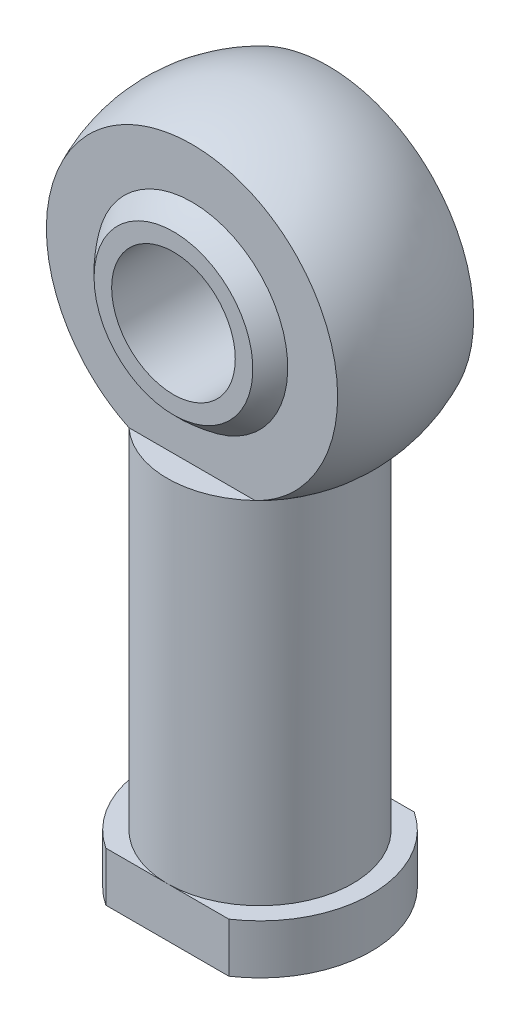
ISO-10303-21;
HEADER;
FILE_DESCRIPTION(('STEP AP214'),'2;1');
FILE_NAME('part.step','',(''),(''),'','','');
FILE_SCHEMA(('AUTOMOTIVE_DESIGN { 1 0 10303 214 1 1 1 1 }'));
ENDSEC;
DATA;
#1=APPLICATION_CONTEXT('core data for automotive mechanical design processes');
#2=APPLICATION_PROTOCOL_DEFINITION('international standard','automotive_design',2000,#1);
#3=PRODUCT_CONTEXT('',#1,'mechanical');
#4=PRODUCT('Part','Part','',(#3));
#5=PRODUCT_RELATED_PRODUCT_CATEGORY('part','',(#4));
#6=PRODUCT_DEFINITION_FORMATION('','',#4);
#7=PRODUCT_DEFINITION_CONTEXT('part definition',#1,'design');
#8=PRODUCT_DEFINITION('design','',#6,#7);
#9=PRODUCT_DEFINITION_SHAPE('','',#8);
#10=(LENGTH_UNIT() NAMED_UNIT(*) SI_UNIT(.MILLI.,.METRE.));
#11=(NAMED_UNIT(*) PLANE_ANGLE_UNIT() SI_UNIT($,.RADIAN.));
#12=(NAMED_UNIT(*) SI_UNIT($,.STERADIAN.) SOLID_ANGLE_UNIT());
#13=UNCERTAINTY_MEASURE_WITH_UNIT(LENGTH_MEASURE(1.E-05),#10,'distance_accuracy_value','');
#14=(GEOMETRIC_REPRESENTATION_CONTEXT(3) GLOBAL_UNCERTAINTY_ASSIGNED_CONTEXT((#13)) GLOBAL_UNIT_ASSIGNED_CONTEXT((#10,
#11,#12)) REPRESENTATION_CONTEXT('',''));
#15=CARTESIAN_POINT('',(0.,0.,0.));
#16=DIRECTION('',(0.,0.,1.));
#17=DIRECTION('',(1.,0.,0.));
#18=AXIS2_PLACEMENT_3D('',#15,#16,#17);
#19=CARTESIAN_POINT('',(0.,4.,0.));
#20=DIRECTION('',(0.,-1.,0.));
#21=DIRECTION('',(0.,0.,-1.));
#22=AXIS2_PLACEMENT_3D('',#19,#20,#21);
#23=PLANE('',#22);
#24=DIRECTION('',(1.,0.,0.));
#25=VECTOR('',#24,1.);
#26=CARTESIAN_POINT('',(0.,4.,-7.5));
#27=LINE('',#26,#25);
#28=CARTESIAN_POINT('',(-4.9749371855331,4.,-7.5));
#29=VERTEX_POINT('',#28);
#30=CARTESIAN_POINT('',(0.,4.,-7.5));
#31=VERTEX_POINT('',#30);
#32=EDGE_CURVE('E157',#29,#31,#27,.T.);
#33=ORIENTED_EDGE('',*,*,#32,.F.);
#34=CARTESIAN_POINT('',(0.,4.,0.));
#35=DIRECTION('',(0.,-1.,0.));
#36=DIRECTION('',(0.,0.,-1.));
#37=AXIS2_PLACEMENT_3D('',#34,#35,#36);
#38=CIRCLE('',#37,9.);
#39=CARTESIAN_POINT('',(-4.9749371855331,4.,7.5));
#40=VERTEX_POINT('',#39);
#41=EDGE_CURVE('E128',#40,#29,#38,.T.);
#42=ORIENTED_EDGE('',*,*,#41,.F.);
#43=DIRECTION('',(-1.,0.,0.));
#44=VECTOR('',#43,1.);
#45=CARTESIAN_POINT('',(0.,4.,7.5));
#46=LINE('',#45,#44);
#47=CARTESIAN_POINT('',(0.,4.,7.5));
#48=VERTEX_POINT('',#47);
#49=EDGE_CURVE('E256',#48,#40,#46,.T.);
#50=ORIENTED_EDGE('',*,*,#49,.F.);
#51=CARTESIAN_POINT('',(0.,4.,0.));
#52=DIRECTION('',(0.,-1.,0.));
#53=DIRECTION('',(0.,0.,-1.));
#54=AXIS2_PLACEMENT_3D('',#51,#52,#53);
#55=CIRCLE('',#54,7.5);
#56=EDGE_CURVE('E140',#48,#31,#55,.T.);
#57=ORIENTED_EDGE('',*,*,#56,.T.);
#58=EDGE_LOOP('',(#33,#42,#50,#57));
#59=FACE_BOUND('',#58,.T.);
#60=ADVANCED_FACE('F45',(#59),#23,.F.);
#61=CARTESIAN_POINT('',(4.9749371855331,4.,-7.5));
#62=VERTEX_POINT('',#61);
#63=EDGE_CURVE('E164',#31,#62,#27,.T.);
#64=ORIENTED_EDGE('',*,*,#63,.F.);
#65=EDGE_CURVE('E141',#31,#48,#55,.T.);
#66=ORIENTED_EDGE('',*,*,#65,.T.);
#67=CARTESIAN_POINT('',(4.9749371855331,4.,7.5));
#68=VERTEX_POINT('',#67);
#69=EDGE_CURVE('E259',#68,#48,#46,.T.);
#70=ORIENTED_EDGE('',*,*,#69,.F.);
#71=EDGE_CURVE('E122',#62,#68,#38,.T.);
#72=ORIENTED_EDGE('',*,*,#71,.F.);
#73=EDGE_LOOP('',(#64,#66,#70,#72));
#74=FACE_BOUND('',#73,.T.);
#75=ADVANCED_FACE('F223',(#74),#23,.F.);
#76=CARTESIAN_POINT('',(0.,0.,0.));
#77=DIRECTION('',(0.,-1.,0.));
#78=DIRECTION('',(0.,0.,-1.));
#79=AXIS2_PLACEMENT_3D('',#76,#77,#78);
#80=CYLINDRICAL_SURFACE('',#79,9.);
#81=DIRECTION('',(0.,-1.,0.));
#82=VECTOR('',#81,1.);
#83=CARTESIAN_POINT('',(4.9749371855331,0.,-7.5));
#84=LINE('',#83,#82);
#85=CARTESIAN_POINT('',(4.9749371855331,0.,-7.5));
#86=VERTEX_POINT('',#85);
#87=EDGE_CURVE('E72',#62,#86,#84,.T.);
#88=ORIENTED_EDGE('',*,*,#87,.F.);
#89=ORIENTED_EDGE('',*,*,#71,.T.);
#90=DIRECTION('',(0.,-1.,0.));
#91=VECTOR('',#90,1.);
#92=CARTESIAN_POINT('',(4.9749371855331,0.,7.5));
#93=LINE('',#92,#91);
#94=CARTESIAN_POINT('',(4.9749371855331,0.,7.5));
#95=VERTEX_POINT('',#94);
#96=EDGE_CURVE('E108',#95,#68,#93,.F.);
#97=ORIENTED_EDGE('',*,*,#96,.F.);
#98=CARTESIAN_POINT('',(0.,0.,0.));
#99=DIRECTION('',(0.,-1.,0.));
#100=DIRECTION('',(0.,0.,-1.));
#101=AXIS2_PLACEMENT_3D('',#98,#99,#100);
#102=CIRCLE('',#101,9.);
#103=EDGE_CURVE('E120',#86,#95,#102,.T.);
#104=ORIENTED_EDGE('',*,*,#103,.F.);
#105=EDGE_LOOP('',(#88,#89,#97,#104));
#106=FACE_BOUND('',#105,.T.);
#107=ADVANCED_FACE('F119',(#106),#80,.T.);
#108=DIRECTION('',(0.,-1.,0.));
#109=VECTOR('',#108,1.);
#110=CARTESIAN_POINT('',(-4.9749371855331,0.,-7.5));
#111=LINE('',#110,#109);
#112=CARTESIAN_POINT('',(-4.9749371855331,0.,-7.5));
#113=VERTEX_POINT('',#112);
#114=EDGE_CURVE('E261',#113,#29,#111,.F.);
#115=ORIENTED_EDGE('',*,*,#114,.F.);
#116=CARTESIAN_POINT('',(-4.9749371855331,0.,7.5));
#117=VERTEX_POINT('',#116);
#118=EDGE_CURVE('E129',#117,#113,#102,.T.);
#119=ORIENTED_EDGE('',*,*,#118,.F.);
#120=DIRECTION('',(0.,-1.,0.));
#121=VECTOR('',#120,1.);
#122=CARTESIAN_POINT('',(-4.9749371855331,0.,7.5));
#123=LINE('',#122,#121);
#124=EDGE_CURVE('E64',#40,#117,#123,.T.);
#125=ORIENTED_EDGE('',*,*,#124,.F.);
#126=ORIENTED_EDGE('',*,*,#41,.T.);
#127=EDGE_LOOP('',(#115,#119,#125,#126));
#128=FACE_BOUND('',#127,.T.);
#129=ADVANCED_FACE('F234',(#128),#80,.T.);
#130=CARTESIAN_POINT('',(0.,0.,0.));
#131=DIRECTION('',(0.,1.,0.));
#132=DIRECTION('',(0.,0.,1.));
#133=AXIS2_PLACEMENT_3D('',#130,#131,#132);
#134=PLANE('',#133);
#135=CARTESIAN_POINT('',(0.,0.,0.));
#136=DIRECTION('',(0.,1.,0.));
#137=DIRECTION('',(0.,0.,1.));
#138=AXIS2_PLACEMENT_3D('',#135,#136,#137);
#139=CIRCLE('',#138,5.);
#140=CARTESIAN_POINT('',(0.,0.,5.));
#141=VERTEX_POINT('',#140);
#142=EDGE_CURVE('E49',#141,#141,#139,.F.);
#143=ORIENTED_EDGE('',*,*,#142,.F.);
#144=EDGE_LOOP('',(#143));
#145=FACE_BOUND('',#144,.T.);
#146=DIRECTION('',(-1.,0.,0.));
#147=VECTOR('',#146,1.);
#148=CARTESIAN_POINT('',(0.,0.,-7.5));
#149=LINE('',#148,#147);
#150=EDGE_CURVE('E126',#86,#113,#149,.T.);
#151=ORIENTED_EDGE('',*,*,#150,.F.);
#152=ORIENTED_EDGE('',*,*,#103,.T.);
#153=DIRECTION('',(1.,0.,0.));
#154=VECTOR('',#153,1.);
#155=CARTESIAN_POINT('',(0.,0.,7.5));
#156=LINE('',#155,#154);
#157=EDGE_CURVE('E105',#117,#95,#156,.T.);
#158=ORIENTED_EDGE('',*,*,#157,.F.);
#159=ORIENTED_EDGE('',*,*,#118,.T.);
#160=EDGE_LOOP('',(#151,#152,#158,#159));
#161=FACE_BOUND('',#160,.T.);
#162=ADVANCED_FACE('F125',(#145,#161),#134,.F.);
#163=CARTESIAN_POINT('',(0.,43.,0.));
#164=DIRECTION('',(0.,-1.,0.));
#165=DIRECTION('',(-1.,0.,0.));
#166=AXIS2_PLACEMENT_3D('',#163,#164,#165);
#167=SPHERICAL_SURFACE('',#166,13.);
#168=CARTESIAN_POINT('',(0.,32.3816197092023,0.));
#169=DIRECTION('',(0.,-1.,0.));
#170=DIRECTION('',(0.,0.,-1.));
#171=AXIS2_PLACEMENT_3D('',#168,#169,#170);
#172=CIRCLE('',#171,7.5);
#173=CARTESIAN_POINT('',(-5.09901951359277,32.3816197092023,5.50000000000001));
#174=VERTEX_POINT('',#173);
#175=CARTESIAN_POINT('',(-5.09901951359277,32.3816197092023,-5.50000000000001));
#176=VERTEX_POINT('',#175);
#177=EDGE_CURVE('E197',#174,#176,#172,.T.);
#178=ORIENTED_EDGE('',*,*,#177,.F.);
#179=CARTESIAN_POINT('',(0.,43.,5.50000000000001));
#180=DIRECTION('',(0.,0.,-1.));
#181=DIRECTION('',(0.,1.,0.));
#182=AXIS2_PLACEMENT_3D('',#179,#180,#181);
#183=CIRCLE('',#182,11.7792189893897);
#184=CARTESIAN_POINT('',(5.09901951359277,32.3816197092023,5.50000000000001));
#185=VERTEX_POINT('',#184);
#186=EDGE_CURVE('E135',#174,#185,#183,.T.);
#187=ORIENTED_EDGE('',*,*,#186,.T.);
#188=CARTESIAN_POINT('',(5.09901951359277,32.3816197092023,-5.50000000000001));
#189=VERTEX_POINT('',#188);
#190=EDGE_CURVE('E12',#189,#185,#172,.T.);
#191=ORIENTED_EDGE('',*,*,#190,.F.);
#192=CARTESIAN_POINT('',(0.,43.,-5.50000000000001));
#193=DIRECTION('',(0.,0.,1.));
#194=DIRECTION('',(0.,-1.,0.));
#195=AXIS2_PLACEMENT_3D('',#192,#193,#194);
#196=CIRCLE('',#195,11.7792189893897);
#197=EDGE_CURVE('E184',#189,#176,#196,.T.);
#198=ORIENTED_EDGE('',*,*,#197,.T.);
#199=EDGE_LOOP('',(#178,#187,#191,#198));
#200=FACE_BOUND('',#199,.T.);
#201=ADVANCED_FACE('F47',(#200),#167,.T.);
#202=CARTESIAN_POINT('',(0.,0.,0.));
#203=DIRECTION('',(0.,-1.,0.));
#204=DIRECTION('',(0.,0.,-1.));
#205=AXIS2_PLACEMENT_3D('',#202,#203,#204);
#206=CYLINDRICAL_SURFACE('',#205,7.5);
#207=EDGE_CURVE('E57',#176,#189,#172,.T.);
#208=ORIENTED_EDGE('',*,*,#207,.T.);
#209=ORIENTED_EDGE('',*,*,#190,.T.);
#210=EDGE_CURVE('E55',#185,#174,#172,.T.);
#211=ORIENTED_EDGE('',*,*,#210,.T.);
#212=ORIENTED_EDGE('',*,*,#177,.T.);
#213=EDGE_LOOP('',(#208,#209,#211,#212));
#214=FACE_BOUND('',#213,.T.);
#215=ORIENTED_EDGE('',*,*,#65,.F.);
#216=ORIENTED_EDGE('',*,*,#56,.F.);
#217=EDGE_LOOP('',(#215,#216));
#218=FACE_BOUND('',#217,.T.);
#219=ADVANCED_FACE('F200',(#214,#218),#206,.T.);
#220=CARTESIAN_POINT('',(-13.,62.8909424581404,-5.50000000000002));
#221=DIRECTION('',(0.,0.,1.));
#222=DIRECTION('',(0.,-1.,0.));
#223=AXIS2_PLACEMENT_3D('',#220,#221,#222);
#224=PLANE('',#223);
#225=CARTESIAN_POINT('',(0.,43.,-5.50000000000001));
#226=DIRECTION('',(0.,0.,1.));
#227=DIRECTION('',(0.,-1.,0.));
#228=AXIS2_PLACEMENT_3D('',#225,#226,#227);
#229=CIRCLE('',#228,7.74596669241483);
#230=CARTESIAN_POINT('',(0.,35.2540333075852,-5.50000000000001));
#231=VERTEX_POINT('',#230);
#232=EDGE_CURVE('E175',#231,#231,#229,.F.);
#233=ORIENTED_EDGE('',*,*,#232,.F.);
#234=EDGE_LOOP('',(#233));
#235=FACE_BOUND('',#234,.T.);
#236=DIRECTION('',(1.,0.,0.));
#237=VECTOR('',#236,1.);
#238=CARTESIAN_POINT('',(-13.,32.3816197092023,-5.50000000000001));
#239=LINE('',#238,#237);
#240=EDGE_CURVE('E179',#176,#189,#239,.T.);
#241=ORIENTED_EDGE('',*,*,#240,.F.);
#242=ORIENTED_EDGE('',*,*,#197,.F.);
#243=EDGE_LOOP('',(#241,#242));
#244=FACE_BOUND('',#243,.T.);
#245=ADVANCED_FACE('F208',(#235,#244),#224,.F.);
#246=CARTESIAN_POINT('',(-13.,32.3816197092023,-23.0792890347279));
#247=DIRECTION('',(0.,-1.,0.));
#248=DIRECTION('',(0.,0.,-1.));
#249=AXIS2_PLACEMENT_3D('',#246,#247,#248);
#250=PLANE('',#249);
#251=ORIENTED_EDGE('',*,*,#207,.F.);
#252=ORIENTED_EDGE('',*,*,#240,.T.);
#253=EDGE_LOOP('',(#251,#252));
#254=FACE_BOUND('',#253,.T.);
#255=ADVANCED_FACE('F206',(#254),#250,.F.);
#256=CARTESIAN_POINT('',(-13.,62.8909424581404,5.50000000000002));
#257=DIRECTION('',(0.,0.,-1.));
#258=DIRECTION('',(0.,1.,0.));
#259=AXIS2_PLACEMENT_3D('',#256,#257,#258);
#260=PLANE('',#259);
#261=CARTESIAN_POINT('',(0.,43.,5.50000000000001));
#262=DIRECTION('',(0.,0.,-1.));
#263=DIRECTION('',(0.,1.,0.));
#264=AXIS2_PLACEMENT_3D('',#261,#262,#263);
#265=CIRCLE('',#264,7.74596669241483);
#266=CARTESIAN_POINT('',(0.,50.7459666924148,5.50000000000001));
#267=VERTEX_POINT('',#266);
#268=EDGE_CURVE('E153',#267,#267,#265,.F.);
#269=ORIENTED_EDGE('',*,*,#268,.F.);
#270=EDGE_LOOP('',(#269));
#271=FACE_BOUND('',#270,.T.);
#272=DIRECTION('',(1.,0.,0.));
#273=VECTOR('',#272,1.);
#274=CARTESIAN_POINT('',(-13.,32.3816197092023,5.50000000000001));
#275=LINE('',#274,#273);
#276=EDGE_CURVE('E180',#174,#185,#275,.T.);
#277=ORIENTED_EDGE('',*,*,#276,.T.);
#278=ORIENTED_EDGE('',*,*,#186,.F.);
#279=EDGE_LOOP('',(#277,#278));
#280=FACE_BOUND('',#279,.T.);
#281=ADVANCED_FACE('F217',(#271,#280),#260,.F.);
#282=CARTESIAN_POINT('',(-13.,32.3816197092023,23.0792890347279));
#283=DIRECTION('',(0.,-1.,0.));
#284=DIRECTION('',(0.,0.,-1.));
#285=AXIS2_PLACEMENT_3D('',#282,#283,#284);
#286=PLANE('',#285);
#287=ORIENTED_EDGE('',*,*,#210,.F.);
#288=ORIENTED_EDGE('',*,*,#276,.F.);
#289=EDGE_LOOP('',(#287,#288));
#290=FACE_BOUND('',#289,.T.);
#291=ADVANCED_FACE('F301',(#290),#286,.F.);
#292=CARTESIAN_POINT('',(0.,43.,0.));
#293=DIRECTION('',(0.,-1.,0.));
#294=DIRECTION('',(-1.,0.,0.));
#295=AXIS2_PLACEMENT_3D('',#292,#293,#294);
#296=SPHERICAL_SURFACE('',#295,9.5);
#297=CARTESIAN_POINT('',(0.,43.,0.));
#298=DIRECTION('',(0.,0.,-1.));
#299=DIRECTION('',(-1.,0.,0.));
#300=AXIS2_PLACEMENT_3D('',#297,#298,#299);
#301=SPHERICAL_SURFACE('',#300,9.5);
#302=CARTESIAN_POINT('',(0.,43.,7.));
#303=DIRECTION('',(0.,0.,-1.));
#304=DIRECTION('',(-1.,0.,0.));
#305=AXIS2_PLACEMENT_3D('',#302,#303,#304);
#306=CIRCLE('',#305,6.42261628933256);
#307=CARTESIAN_POINT('',(-6.42261628933256,43.,7.));
#308=VERTEX_POINT('',#307);
#309=EDGE_CURVE('E149',#308,#308,#306,.T.);
#310=ORIENTED_EDGE('',*,*,#309,.T.);
#311=EDGE_LOOP('',(#310));
#312=FACE_BOUND('',#311,.T.);
#313=ORIENTED_EDGE('',*,*,#268,.T.);
#314=EDGE_LOOP('',(#313));
#315=FACE_BOUND('',#314,.T.);
#316=ADVANCED_FACE('F299',(#312,#315),#301,.T.);
#317=CARTESIAN_POINT('',(0.,43.,0.));
#318=DIRECTION('',(0.,0.,1.));
#319=DIRECTION('',(1.,0.,0.));
#320=AXIS2_PLACEMENT_3D('',#317,#318,#319);
#321=SPHERICAL_SURFACE('',#320,9.5);
#322=CARTESIAN_POINT('',(0.,43.,-7.));
#323=DIRECTION('',(0.,0.,1.));
#324=DIRECTION('',(1.,0.,0.));
#325=AXIS2_PLACEMENT_3D('',#322,#323,#324);
#326=CIRCLE('',#325,6.42261628933256);
#327=CARTESIAN_POINT('',(6.42261628933256,43.,-7.));
#328=VERTEX_POINT('',#327);
#329=EDGE_CURVE('E145',#328,#328,#326,.T.);
#330=ORIENTED_EDGE('',*,*,#329,.T.);
#331=EDGE_LOOP('',(#330));
#332=FACE_BOUND('',#331,.T.);
#333=ORIENTED_EDGE('',*,*,#232,.T.);
#334=EDGE_LOOP('',(#333));
#335=FACE_BOUND('',#334,.T.);
#336=ADVANCED_FACE('F295',(#332,#335),#321,.T.);
#337=CARTESIAN_POINT('',(-13.,55.339914288414,-7.));
#338=DIRECTION('',(0.,0.,1.));
#339=DIRECTION('',(1.,0.,0.));
#340=AXIS2_PLACEMENT_3D('',#337,#338,#339);
#341=PLANE('',#340);
#342=CARTESIAN_POINT('',(0.,43.,-7.));
#343=DIRECTION('',(0.,0.,1.));
#344=DIRECTION('',(1.,0.,0.));
#345=AXIS2_PLACEMENT_3D('',#342,#343,#344);
#346=CIRCLE('',#345,5.);
#347=CARTESIAN_POINT('',(5.,43.,-7.));
#348=VERTEX_POINT('',#347);
#349=EDGE_CURVE('E150',#348,#348,#346,.T.);
#350=ORIENTED_EDGE('',*,*,#349,.T.);
#351=EDGE_LOOP('',(#350));
#352=FACE_BOUND('',#351,.T.);
#353=ORIENTED_EDGE('',*,*,#329,.F.);
#354=EDGE_LOOP('',(#353));
#355=FACE_BOUND('',#354,.T.);
#356=ADVANCED_FACE('F292',(#352,#355),#341,.F.);
#357=CARTESIAN_POINT('',(-13.,55.339914288414,7.));
#358=DIRECTION('',(0.,0.,-1.));
#359=DIRECTION('',(-1.,0.,0.));
#360=AXIS2_PLACEMENT_3D('',#357,#358,#359);
#361=PLANE('',#360);
#362=CARTESIAN_POINT('',(0.,43.,7.));
#363=DIRECTION('',(0.,0.,-1.));
#364=DIRECTION('',(-1.,0.,0.));
#365=AXIS2_PLACEMENT_3D('',#362,#363,#364);
#366=CIRCLE('',#365,5.);
#367=CARTESIAN_POINT('',(-5.,43.,7.));
#368=VERTEX_POINT('',#367);
#369=EDGE_CURVE('E154',#368,#368,#366,.T.);
#370=ORIENTED_EDGE('',*,*,#369,.T.);
#371=EDGE_LOOP('',(#370));
#372=FACE_BOUND('',#371,.T.);
#373=ORIENTED_EDGE('',*,*,#309,.F.);
#374=EDGE_LOOP('',(#373));
#375=FACE_BOUND('',#374,.T.);
#376=ADVANCED_FACE('F288',(#372,#375),#361,.F.);
#377=CARTESIAN_POINT('',(0.,43.,-9.));
#378=DIRECTION('',(0.,0.,1.));
#379=DIRECTION('',(1.,0.,0.));
#380=AXIS2_PLACEMENT_3D('',#377,#378,#379);
#381=CYLINDRICAL_SURFACE('',#380,5.);
#382=ORIENTED_EDGE('',*,*,#369,.F.);
#383=EDGE_LOOP('',(#382));
#384=FACE_BOUND('',#383,.T.);
#385=ORIENTED_EDGE('',*,*,#349,.F.);
#386=EDGE_LOOP('',(#385));
#387=FACE_BOUND('',#386,.T.);
#388=ADVANCED_FACE('F283',(#384,#387),#381,.F.);
#389=CARTESIAN_POINT('',(-7.56111721977776,56.,7.5));
#390=DIRECTION('',(0.,0.,1.));
#391=DIRECTION('',(1.,0.,0.));
#392=AXIS2_PLACEMENT_3D('',#389,#390,#391);
#393=PLANE('',#392);
#394=ORIENTED_EDGE('',*,*,#69,.T.);
#395=ORIENTED_EDGE('',*,*,#49,.T.);
#396=ORIENTED_EDGE('',*,*,#124,.T.);
#397=ORIENTED_EDGE('',*,*,#157,.T.);
#398=ORIENTED_EDGE('',*,*,#96,.T.);
#399=EDGE_LOOP('',(#394,#395,#396,#397,#398));
#400=FACE_BOUND('',#399,.T.);
#401=ADVANCED_FACE('F107',(#400),#393,.T.);
#402=CARTESIAN_POINT('',(-7.56111721977776,56.,-7.5));
#403=DIRECTION('',(0.,0.,-1.));
#404=DIRECTION('',(-1.,0.,0.));
#405=AXIS2_PLACEMENT_3D('',#402,#403,#404);
#406=PLANE('',#405);
#407=ORIENTED_EDGE('',*,*,#32,.T.);
#408=ORIENTED_EDGE('',*,*,#63,.T.);
#409=ORIENTED_EDGE('',*,*,#87,.T.);
#410=ORIENTED_EDGE('',*,*,#150,.T.);
#411=ORIENTED_EDGE('',*,*,#114,.T.);
#412=EDGE_LOOP('',(#407,#408,#409,#410,#411));
#413=FACE_BOUND('',#412,.T.);
#414=ADVANCED_FACE('F265',(#413),#406,.T.);
#415=CARTESIAN_POINT('',(0.,-1.2E-05,0.));
#416=DIRECTION('',(0.,1.,0.));
#417=DIRECTION('',(0.,0.,1.));
#418=AXIS2_PLACEMENT_3D('',#415,#416,#417);
#419=CYLINDRICAL_SURFACE('',#418,5.);
#420=CARTESIAN_POINT('',(0.,25.,0.));
#421=DIRECTION('',(0.,-1.,0.));
#422=DIRECTION('',(0.,0.,-1.));
#423=AXIS2_PLACEMENT_3D('',#420,#421,#422);
#424=CIRCLE('',#423,5.);
#425=CARTESIAN_POINT('',(0.,25.,5.));
#426=VERTEX_POINT('',#425);
#427=EDGE_CURVE('E247',#426,#426,#424,.T.);
#428=CARTESIAN_POINT('',(0.,25.,5.));
#429=CARTESIAN_POINT('',(0.,24.7395833333333,5.));
#430=CARTESIAN_POINT('',(0.,24.4791666666667,5.));
#431=CARTESIAN_POINT('',(0.,23.9583333333333,5.));
#432=CARTESIAN_POINT('',(0.,23.6979166666667,5.));
#433=CARTESIAN_POINT('',(0.,23.1770833333333,5.));
#434=CARTESIAN_POINT('',(0.,22.9166666666667,5.));
#435=CARTESIAN_POINT('',(0.,22.3958333333333,5.));
#436=CARTESIAN_POINT('',(0.,22.1354166666667,5.));
#437=CARTESIAN_POINT('',(0.,21.6145833333333,5.));
#438=CARTESIAN_POINT('',(0.,21.3541666666667,5.));
#439=CARTESIAN_POINT('',(0.,20.8333333333333,5.));
#440=CARTESIAN_POINT('',(0.,20.5729166666667,5.));
#441=CARTESIAN_POINT('',(0.,20.0520833333333,5.));
#442=CARTESIAN_POINT('',(0.,19.7916666666667,5.));
#443=CARTESIAN_POINT('',(0.,19.2708333333333,5.));
#444=CARTESIAN_POINT('',(0.,19.0104166666667,5.));
#445=CARTESIAN_POINT('',(0.,18.4895833333333,5.));
#446=CARTESIAN_POINT('',(0.,18.2291666666667,5.));
#447=CARTESIAN_POINT('',(0.,17.7083333333333,5.));
#448=CARTESIAN_POINT('',(0.,17.4479166666667,5.));
#449=CARTESIAN_POINT('',(0.,16.9270833333333,5.));
#450=CARTESIAN_POINT('',(0.,16.6666666666667,5.));
#451=CARTESIAN_POINT('',(0.,16.1458333333333,5.));
#452=CARTESIAN_POINT('',(0.,15.8854166666667,5.));
#453=CARTESIAN_POINT('',(0.,15.3645833333333,5.));
#454=CARTESIAN_POINT('',(0.,15.1041666666667,5.));
#455=CARTESIAN_POINT('',(0.,14.5833333333333,5.));
#456=CARTESIAN_POINT('',(0.,14.3229166666667,5.));
#457=CARTESIAN_POINT('',(0.,13.8020833333333,5.));
#458=CARTESIAN_POINT('',(0.,13.5416666666667,5.));
#459=CARTESIAN_POINT('',(0.,13.0208333333333,5.));
#460=CARTESIAN_POINT('',(0.,12.7604166666667,5.));
#461=CARTESIAN_POINT('',(0.,12.2395833333333,5.));
#462=CARTESIAN_POINT('',(0.,11.9791666666667,5.));
#463=CARTESIAN_POINT('',(0.,11.4583333333333,5.));
#464=CARTESIAN_POINT('',(0.,11.1979166666667,5.));
#465=CARTESIAN_POINT('',(0.,10.6770833333333,5.));
#466=CARTESIAN_POINT('',(0.,10.4166666666667,5.));
#467=CARTESIAN_POINT('',(0.,9.89583333333334,5.));
#468=CARTESIAN_POINT('',(0.,9.63541666666667,5.));
#469=CARTESIAN_POINT('',(0.,9.11458333333334,5.));
#470=CARTESIAN_POINT('',(0.,8.85416666666667,5.));
#471=CARTESIAN_POINT('',(0.,8.33333333333334,5.));
#472=CARTESIAN_POINT('',(0.,8.07291666666667,5.));
#473=CARTESIAN_POINT('',(0.,7.55208333333333,5.));
#474=CARTESIAN_POINT('',(0.,7.29166666666667,5.));
#475=CARTESIAN_POINT('',(0.,6.77083333333334,5.));
#476=CARTESIAN_POINT('',(0.,6.51041666666667,5.));
#477=CARTESIAN_POINT('',(0.,5.98958333333334,5.));
#478=CARTESIAN_POINT('',(0.,5.72916666666667,5.));
#479=CARTESIAN_POINT('',(0.,5.20833333333334,5.));
#480=CARTESIAN_POINT('',(0.,4.94791666666667,5.));
#481=CARTESIAN_POINT('',(0.,4.42708333333334,5.));
#482=CARTESIAN_POINT('',(0.,4.16666666666667,5.));
#483=CARTESIAN_POINT('',(0.,3.64583333333334,5.));
#484=CARTESIAN_POINT('',(0.,3.38541666666667,5.));
#485=CARTESIAN_POINT('',(0.,2.86458333333334,5.));
#486=CARTESIAN_POINT('',(0.,2.60416666666667,5.));
#487=CARTESIAN_POINT('',(0.,2.08333333333334,5.));
#488=CARTESIAN_POINT('',(0.,1.82291666666667,5.));
#489=CARTESIAN_POINT('',(0.,1.30208333333334,5.));
#490=CARTESIAN_POINT('',(0.,1.04166666666667,5.));
#491=CARTESIAN_POINT('',(0.,0.520833333333334,5.));
#492=CARTESIAN_POINT('',(0.,0.260416666666668,5.));
#493=CARTESIAN_POINT('',(0.,0.,5.));
#494=B_SPLINE_CURVE_WITH_KNOTS('',3,(#428,#429,#430,#431,#432,#433,#434,#435,#436,#437,#438,
#439,#440,#441,#442,#443,#444,#445,#446,#447,#448,#449,#450,#451,#452,#453,#454,#455,#456,#457,
#458,#459,#460,#461,#462,#463,#464,#465,#466,#467,#468,#469,#470,#471,#472,#473,#474,#475,#476,
#477,#478,#479,#480,#481,#482,#483,#484,#485,#486,#487,#488,#489,#490,#491,#492,#493),
.UNSPECIFIED.,.F.,.F.,(4,2,2,2,2,2,2,2,2,2,2,2,2,2,2,2,2,2,2,2,2,2,2,2,2,2,2,2,2,2,2,2,4),(0.,
0.781250000000001,1.5625,2.34375,3.125,3.90625,4.6875,5.46875,6.25000000000001,7.03125,
7.81250000000001,8.59375,9.37500000000001,10.15625,10.9375,11.71875,12.5,13.28125,14.0625,
14.84375,15.625,16.40625,17.1875,17.96875,18.75,19.53125,20.3125,21.09375,21.875,22.65625,
23.4375,24.21875,25.),.UNSPECIFIED.);
#495=EDGE_CURVE('BSEAM275',#426,#141,#494,.T.);
#496=ORIENTED_EDGE('',*,*,#427,.F.);
#497=ORIENTED_EDGE('',*,*,#142,.T.);
#498=ORIENTED_EDGE('',*,*,#495,.T.);
#499=ORIENTED_EDGE('',*,*,#495,.F.);
#500=EDGE_LOOP('',(#496,#498,#497,#499));
#501=FACE_BOUND('',#500,.T.);
#502=ADVANCED_FACE('F275',(#501),#419,.F.);
#503=CARTESIAN_POINT('',(0.,25.,0.));
#504=DIRECTION('',(0.,-1.,0.));
#505=DIRECTION('',(0.,0.,-1.));
#506=AXIS2_PLACEMENT_3D('',#503,#504,#505);
#507=PLANE('',#506);
#508=ORIENTED_EDGE('',*,*,#427,.T.);
#509=EDGE_LOOP('',(#508));
#510=FACE_BOUND('',#509,.T.);
#511=ADVANCED_FACE('F280',(#510),#507,.T.);
#512=CLOSED_SHELL('',(#60,#75,#107,#129,#162,#201,#219,#245,#255,#281,#291,#316,#336,#356,#376,
#388,#401,#414,#502,#511));
#513=MANIFOLD_SOLID_BREP('B2',#512);
#514=ADVANCED_BREP_SHAPE_REPRESENTATION('',(#18,#513),#14);
#515=SHAPE_DEFINITION_REPRESENTATION(#9,#514);
ENDSEC;
END-ISO-10303-21;
